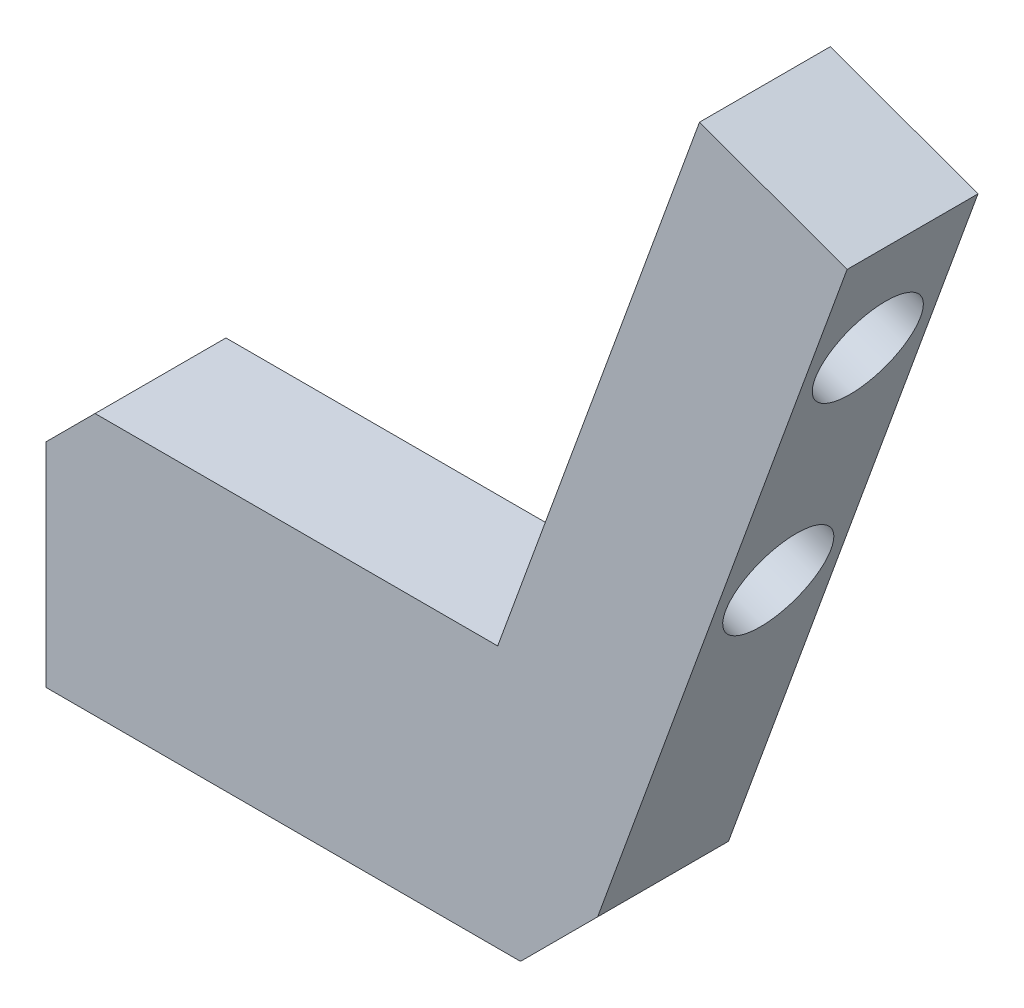
ISO-10303-21;
HEADER;
FILE_DESCRIPTION(('STEP AP214'),'2;1');
FILE_NAME('part.step','',(''),(''),'','','');
FILE_SCHEMA(('AUTOMOTIVE_DESIGN { 1 0 10303 214 1 1 1 1 }'));
ENDSEC;
DATA;
#1=APPLICATION_CONTEXT('core data for automotive mechanical design processes');
#2=APPLICATION_PROTOCOL_DEFINITION('international standard','automotive_design',2000,#1);
#3=PRODUCT_CONTEXT('',#1,'mechanical');
#4=PRODUCT('Part','Part','',(#3));
#5=PRODUCT_RELATED_PRODUCT_CATEGORY('part','',(#4));
#6=PRODUCT_DEFINITION_FORMATION('','',#4);
#7=PRODUCT_DEFINITION_CONTEXT('part definition',#1,'design');
#8=PRODUCT_DEFINITION('design','',#6,#7);
#9=PRODUCT_DEFINITION_SHAPE('','',#8);
#10=(LENGTH_UNIT() NAMED_UNIT(*) SI_UNIT(.MILLI.,.METRE.));
#11=(NAMED_UNIT(*) PLANE_ANGLE_UNIT() SI_UNIT($,.RADIAN.));
#12=(NAMED_UNIT(*) SI_UNIT($,.STERADIAN.) SOLID_ANGLE_UNIT());
#13=UNCERTAINTY_MEASURE_WITH_UNIT(LENGTH_MEASURE(1.E-05),#10,'distance_accuracy_value','');
#14=(GEOMETRIC_REPRESENTATION_CONTEXT(3) GLOBAL_UNCERTAINTY_ASSIGNED_CONTEXT((#13)) GLOBAL_UNIT_ASSIGNED_CONTEXT((#10,
#11,#12)) REPRESENTATION_CONTEXT('',''));
#15=CARTESIAN_POINT('',(0.,0.,0.));
#16=DIRECTION('',(0.,0.,1.));
#17=DIRECTION('',(1.,0.,0.));
#18=AXIS2_PLACEMENT_3D('',#15,#16,#17);
#19=CARTESIAN_POINT('',(-25.4,12.7,3.175));
#20=DIRECTION('',(1.,0.,0.));
#21=DIRECTION('',(0.,0.,-1.));
#22=AXIS2_PLACEMENT_3D('',#19,#20,#21);
#23=PLANE('',#22);
#24=DIRECTION('',(0.,-1.,0.));
#25=VECTOR('',#24,1.);
#26=CARTESIAN_POINT('',(-25.4,12.7,3.175));
#27=LINE('',#26,#25);
#28=CARTESIAN_POINT('',(-25.4,10.32,3.175));
#29=VERTEX_POINT('',#28);
#30=CARTESIAN_POINT('',(-25.4,0.,3.175));
#31=VERTEX_POINT('',#30);
#32=EDGE_CURVE('E132',#29,#31,#27,.T.);
#33=ORIENTED_EDGE('',*,*,#32,.F.);
#34=DIRECTION('',(0.,0.,-1.));
#35=VECTOR('',#34,1.);
#36=CARTESIAN_POINT('',(-25.4,10.32,3.175));
#37=LINE('',#36,#35);
#38=CARTESIAN_POINT('',(-25.4,10.32,-3.175));
#39=VERTEX_POINT('',#38);
#40=EDGE_CURVE('E169',#29,#39,#37,.T.);
#41=ORIENTED_EDGE('',*,*,#40,.T.);
#42=DIRECTION('',(0.,-1.,0.));
#43=VECTOR('',#42,1.);
#44=CARTESIAN_POINT('',(-25.4,12.7,-3.175));
#45=LINE('',#44,#43);
#46=CARTESIAN_POINT('',(-25.4,0.,-3.175));
#47=VERTEX_POINT('',#46);
#48=EDGE_CURVE('E131',#39,#47,#45,.T.);
#49=ORIENTED_EDGE('',*,*,#48,.T.);
#50=DIRECTION('',(0.,0.,-1.));
#51=VECTOR('',#50,1.);
#52=CARTESIAN_POINT('',(-25.4,0.,3.175));
#53=LINE('',#52,#51);
#54=EDGE_CURVE('E166',#31,#47,#53,.T.);
#55=ORIENTED_EDGE('',*,*,#54,.F.);
#56=EDGE_LOOP('',(#33,#41,#49,#55));
#57=FACE_BOUND('',#56,.T.);
#58=ADVANCED_FACE('F37',(#57),#23,.F.);
#59=CARTESIAN_POINT('',(-25.4,0.,3.175));
#60=DIRECTION('',(0.,1.,0.));
#61=DIRECTION('',(0.,0.,1.));
#62=AXIS2_PLACEMENT_3D('',#59,#60,#61);
#63=PLANE('',#62);
#64=CARTESIAN_POINT('',(-22.225,0.,0.));
#65=DIRECTION('',(0.,-1.,0.));
#66=DIRECTION('',(0.,0.,-1.));
#67=AXIS2_PLACEMENT_3D('',#64,#65,#66);
#68=CIRCLE('',#67,1.89865);
#69=CARTESIAN_POINT('',(-22.225,0.,-1.89865));
#70=VERTEX_POINT('',#69);
#71=EDGE_CURVE('E119',#70,#70,#68,.T.);
#72=ORIENTED_EDGE('',*,*,#71,.F.);
#73=EDGE_LOOP('',(#72));
#74=FACE_BOUND('',#73,.T.);
#75=CARTESIAN_POINT('',(-9.525,0.,0.));
#76=DIRECTION('',(0.,-1.,0.));
#77=DIRECTION('',(0.,0.,-1.));
#78=AXIS2_PLACEMENT_3D('',#75,#76,#77);
#79=CIRCLE('',#78,1.89865);
#80=CARTESIAN_POINT('',(-9.525,0.,-1.89865));
#81=VERTEX_POINT('',#80);
#82=EDGE_CURVE('E118',#81,#81,#79,.T.);
#83=ORIENTED_EDGE('',*,*,#82,.F.);
#84=EDGE_LOOP('',(#83));
#85=FACE_BOUND('',#84,.T.);
#86=DIRECTION('',(1.,0.,0.));
#87=VECTOR('',#86,1.);
#88=CARTESIAN_POINT('',(-25.4,0.,-3.175));
#89=LINE('',#88,#87);
#90=CARTESIAN_POINT('',(-2.38000000000002,0.,-3.175));
#91=VERTEX_POINT('',#90);
#92=EDGE_CURVE('E148',#47,#91,#89,.T.);
#93=ORIENTED_EDGE('',*,*,#92,.T.);
#94=DIRECTION('',(0.,0.,1.));
#95=VECTOR('',#94,1.);
#96=CARTESIAN_POINT('',(-2.38000000000002,0.,3.175));
#97=LINE('',#96,#95);
#98=CARTESIAN_POINT('',(-2.38000000000002,0.,3.175));
#99=VERTEX_POINT('',#98);
#100=EDGE_CURVE('E11',#91,#99,#97,.T.);
#101=ORIENTED_EDGE('',*,*,#100,.T.);
#102=DIRECTION('',(1.,0.,0.));
#103=VECTOR('',#102,1.);
#104=CARTESIAN_POINT('',(-25.4,0.,3.175));
#105=LINE('',#104,#103);
#106=EDGE_CURVE('E134',#31,#99,#105,.T.);
#107=ORIENTED_EDGE('',*,*,#106,.F.);
#108=ORIENTED_EDGE('',*,*,#54,.T.);
#109=EDGE_LOOP('',(#93,#101,#107,#108));
#110=FACE_BOUND('',#109,.T.);
#111=ADVANCED_FACE('F214',(#74,#85,#110),#63,.F.);
#112=CARTESIAN_POINT('',(0.,0.,3.175));
#113=DIRECTION('',(-0.93969262078591,0.342020143325666,0.));
#114=DIRECTION('',(-0.342020143325666,-0.93969262078591,0.));
#115=AXIS2_PLACEMENT_3D('',#112,#113,#114);
#116=PLANE('',#115);
#117=CARTESIAN_POINT('',(11.2935051326135,31.0286503383508,0.));
#118=DIRECTION('',(0.93969262078591,-0.342020143325666,0.));
#119=DIRECTION('',(0.342020143325666,0.93969262078591,0.));
#120=AXIS2_PLACEMENT_3D('',#117,#118,#119);
#121=CIRCLE('',#120,2.5527);
#122=CARTESIAN_POINT('',(12.1665799524809,33.4274036914309,0.));
#123=VERTEX_POINT('',#122);
#124=EDGE_CURVE('E268',#123,#123,#121,.T.);
#125=ORIENTED_EDGE('',*,*,#124,.F.);
#126=EDGE_LOOP('',(#125));
#127=FACE_BOUND('',#126,.T.);
#128=CARTESIAN_POINT('',(6.94984931237753,19.0945540543697,0.));
#129=DIRECTION('',(0.93969262078591,-0.342020143325666,0.));
#130=DIRECTION('',(0.342020143325666,0.93969262078591,0.));
#131=AXIS2_PLACEMENT_3D('',#128,#129,#130);
#132=CIRCLE('',#131,2.5527);
#133=CARTESIAN_POINT('',(7.82292413224496,21.4933074074499,0.));
#134=VERTEX_POINT('',#133);
#135=EDGE_CURVE('E271',#134,#134,#132,.T.);
#136=ORIENTED_EDGE('',*,*,#135,.F.);
#137=EDGE_LOOP('',(#136));
#138=FACE_BOUND('',#137,.T.);
#139=DIRECTION('',(0.342020143325666,0.93969262078591,0.));
#140=VECTOR('',#139,1.);
#141=CARTESIAN_POINT('',(0.,0.,3.175));
#142=LINE('',#141,#140);
#143=CARTESIAN_POINT('',(1.36196323540636,3.74196323540636,3.175));
#144=VERTEX_POINT('',#143);
#145=CARTESIAN_POINT('',(13.4653330427315,36.9956984803413,3.175));
#146=VERTEX_POINT('',#145);
#147=EDGE_CURVE('E137',#144,#146,#142,.T.);
#148=ORIENTED_EDGE('',*,*,#147,.F.);
#149=DIRECTION('',(0.,0.,-1.));
#150=VECTOR('',#149,1.);
#151=CARTESIAN_POINT('',(1.36196323540636,3.74196323540636,3.175));
#152=LINE('',#151,#150);
#153=CARTESIAN_POINT('',(1.36196323540636,3.74196323540636,-3.175));
#154=VERTEX_POINT('',#153);
#155=EDGE_CURVE('E47',#144,#154,#152,.T.);
#156=ORIENTED_EDGE('',*,*,#155,.T.);
#157=DIRECTION('',(0.342020143325666,0.93969262078591,0.));
#158=VECTOR('',#157,1.);
#159=CARTESIAN_POINT('',(0.,0.,-3.175));
#160=LINE('',#159,#158);
#161=CARTESIAN_POINT('',(13.4653330427315,36.9956984803413,-3.175));
#162=VERTEX_POINT('',#161);
#163=EDGE_CURVE('E150',#154,#162,#160,.T.);
#164=ORIENTED_EDGE('',*,*,#163,.T.);
#165=DIRECTION('',(0.,0.,-1.));
#166=VECTOR('',#165,1.);
#167=CARTESIAN_POINT('',(13.4653330427315,36.9956984803413,3.175));
#168=LINE('',#167,#166);
#169=EDGE_CURVE('E163',#146,#162,#168,.T.);
#170=ORIENTED_EDGE('',*,*,#169,.F.);
#171=EDGE_LOOP('',(#148,#156,#164,#170));
#172=FACE_BOUND('',#171,.T.);
#173=ADVANCED_FACE('F185',(#127,#138,#172),#116,.F.);
#174=CARTESIAN_POINT('',(13.4653330427315,36.9956984803413,3.175));
#175=DIRECTION('',(-0.342020143325664,-0.93969262078591,0.));
#176=DIRECTION('',(0.93969262078591,-0.342020143325665,0.));
#177=AXIS2_PLACEMENT_3D('',#174,#175,#176);
#178=PLANE('',#177);
#179=DIRECTION('',(-0.93969262078591,0.342020143325664,0.));
#180=VECTOR('',#179,1.);
#181=CARTESIAN_POINT('',(13.4653330427315,36.9956984803413,-3.175));
#182=LINE('',#181,#180);
#183=CARTESIAN_POINT('',(6.30487527234282,39.6018919724828,-3.175));
#184=VERTEX_POINT('',#183);
#185=EDGE_CURVE('E152',#162,#184,#182,.T.);
#186=ORIENTED_EDGE('',*,*,#185,.T.);
#187=DIRECTION('',(0.,0.,-1.));
#188=VECTOR('',#187,1.);
#189=CARTESIAN_POINT('',(6.30487527234282,39.6018919724828,3.175));
#190=LINE('',#189,#188);
#191=CARTESIAN_POINT('',(6.30487527234282,39.6018919724828,3.175));
#192=VERTEX_POINT('',#191);
#193=EDGE_CURVE('E160',#192,#184,#190,.T.);
#194=ORIENTED_EDGE('',*,*,#193,.F.);
#195=DIRECTION('',(-0.93969262078591,0.342020143325664,0.));
#196=VECTOR('',#195,1.);
#197=CARTESIAN_POINT('',(13.4653330427315,36.9956984803413,3.175));
#198=LINE('',#197,#196);
#199=EDGE_CURVE('E139',#146,#192,#198,.T.);
#200=ORIENTED_EDGE('',*,*,#199,.F.);
#201=ORIENTED_EDGE('',*,*,#169,.T.);
#202=EDGE_LOOP('',(#186,#194,#200,#201));
#203=FACE_BOUND('',#202,.T.);
#204=ADVANCED_FACE('F197',(#203),#178,.F.);
#205=CARTESIAN_POINT('',(6.30487527234282,39.6018919724828,3.175));
#206=DIRECTION('',(0.93969262078591,-0.342020143325665,0.));
#207=DIRECTION('',(0.342020143325665,0.93969262078591,0.));
#208=AXIS2_PLACEMENT_3D('',#205,#206,#207);
#209=PLANE('',#208);
#210=CARTESIAN_POINT('',(4.13304736222486,33.6348438304923,0.));
#211=DIRECTION('',(0.93969262078591,-0.342020143325665,0.));
#212=DIRECTION('',(0.342020143325665,0.93969262078591,0.));
#213=AXIS2_PLACEMENT_3D('',#210,#211,#212);
#214=CIRCLE('',#213,2.5527);
#215=CARTESIAN_POINT('',(5.00612218209229,36.0335971835725,0.));
#216=VERTEX_POINT('',#215);
#217=EDGE_CURVE('E42',#216,#216,#214,.T.);
#218=ORIENTED_EDGE('',*,*,#217,.T.);
#219=EDGE_LOOP('',(#218));
#220=FACE_BOUND('',#219,.T.);
#221=CARTESIAN_POINT('',(-0.210608458011091,21.7007475465113,0.));
#222=DIRECTION('',(0.93969262078591,-0.342020143325665,0.));
#223=DIRECTION('',(0.342020143325665,0.93969262078591,0.));
#224=AXIS2_PLACEMENT_3D('',#221,#222,#223);
#225=CIRCLE('',#224,2.5527);
#226=CARTESIAN_POINT('',(0.662466361856334,24.0995008995915,0.));
#227=VERTEX_POINT('',#226);
#228=EDGE_CURVE('E125',#227,#227,#225,.T.);
#229=ORIENTED_EDGE('',*,*,#228,.T.);
#230=EDGE_LOOP('',(#229));
#231=FACE_BOUND('',#230,.T.);
#232=DIRECTION('',(-0.342020143325665,-0.93969262078591,0.));
#233=VECTOR('',#232,1.);
#234=CARTESIAN_POINT('',(6.30487527234282,39.6018919724828,-3.175));
#235=LINE('',#234,#233);
#236=CARTESIAN_POINT('',(-3.48661265108571,12.7,-3.175));
#237=VERTEX_POINT('',#236);
#238=EDGE_CURVE('E154',#184,#237,#235,.T.);
#239=ORIENTED_EDGE('',*,*,#238,.T.);
#240=DIRECTION('',(0.,0.,-1.));
#241=VECTOR('',#240,1.);
#242=CARTESIAN_POINT('',(-3.48661265108571,12.7,3.175));
#243=LINE('',#242,#241);
#244=CARTESIAN_POINT('',(-3.48661265108571,12.7,3.175));
#245=VERTEX_POINT('',#244);
#246=EDGE_CURVE('E146',#245,#237,#243,.T.);
#247=ORIENTED_EDGE('',*,*,#246,.F.);
#248=DIRECTION('',(-0.342020143325665,-0.93969262078591,0.));
#249=VECTOR('',#248,1.);
#250=CARTESIAN_POINT('',(6.30487527234282,39.6018919724828,3.175));
#251=LINE('',#250,#249);
#252=EDGE_CURVE('E141',#192,#245,#251,.T.);
#253=ORIENTED_EDGE('',*,*,#252,.F.);
#254=ORIENTED_EDGE('',*,*,#193,.T.);
#255=EDGE_LOOP('',(#239,#247,#253,#254));
#256=FACE_BOUND('',#255,.T.);
#257=ADVANCED_FACE('F201',(#220,#231,#256),#209,.F.);
#258=CARTESIAN_POINT('',(-25.4,12.7,3.175));
#259=DIRECTION('',(0.,-1.,0.));
#260=DIRECTION('',(0.,0.,-1.));
#261=AXIS2_PLACEMENT_3D('',#258,#259,#260);
#262=PLANE('',#261);
#263=DIRECTION('',(-1.,0.,0.));
#264=VECTOR('',#263,1.);
#265=CARTESIAN_POINT('',(-25.4,12.7,-3.175));
#266=LINE('',#265,#264);
#267=CARTESIAN_POINT('',(-23.02,12.7,-3.175));
#268=VERTEX_POINT('',#267);
#269=EDGE_CURVE('E135',#237,#268,#266,.T.);
#270=ORIENTED_EDGE('',*,*,#269,.T.);
#271=DIRECTION('',(0.,0.,1.));
#272=VECTOR('',#271,1.);
#273=CARTESIAN_POINT('',(-23.02,12.7,3.175));
#274=LINE('',#273,#272);
#275=CARTESIAN_POINT('',(-23.02,12.7,3.175));
#276=VERTEX_POINT('',#275);
#277=EDGE_CURVE('E176',#268,#276,#274,.T.);
#278=ORIENTED_EDGE('',*,*,#277,.T.);
#279=DIRECTION('',(-1.,0.,0.));
#280=VECTOR('',#279,1.);
#281=CARTESIAN_POINT('',(-25.4,12.7,3.175));
#282=LINE('',#281,#280);
#283=EDGE_CURVE('E143',#245,#276,#282,.T.);
#284=ORIENTED_EDGE('',*,*,#283,.F.);
#285=ORIENTED_EDGE('',*,*,#246,.T.);
#286=EDGE_LOOP('',(#270,#278,#284,#285));
#287=FACE_BOUND('',#286,.T.);
#288=ADVANCED_FACE('F244',(#287),#262,.F.);
#289=CARTESIAN_POINT('',(0.,0.,3.175));
#290=DIRECTION('',(0.,0.,1.));
#291=DIRECTION('',(1.,0.,0.));
#292=AXIS2_PLACEMENT_3D('',#289,#290,#291);
#293=PLANE('',#292);
#294=ORIENTED_EDGE('',*,*,#283,.T.);
#295=DIRECTION('',(0.707106781186549,0.707106781186546,0.));
#296=VECTOR('',#295,1.);
#297=CARTESIAN_POINT('',(-17.86,17.86,3.175));
#298=LINE('',#297,#296);
#299=EDGE_CURVE('E179',#276,#29,#298,.F.);
#300=ORIENTED_EDGE('',*,*,#299,.T.);
#301=ORIENTED_EDGE('',*,*,#32,.T.);
#302=ORIENTED_EDGE('',*,*,#106,.T.);
#303=DIRECTION('',(-0.707106781186549,-0.707106781186546,0.));
#304=VECTOR('',#303,1.);
#305=CARTESIAN_POINT('',(-1.19,1.19000000000001,3.175));
#306=LINE('',#305,#304);
#307=EDGE_CURVE('E54',#99,#144,#306,.F.);
#308=ORIENTED_EDGE('',*,*,#307,.T.);
#309=ORIENTED_EDGE('',*,*,#147,.T.);
#310=ORIENTED_EDGE('',*,*,#199,.T.);
#311=ORIENTED_EDGE('',*,*,#252,.T.);
#312=EDGE_LOOP('',(#294,#300,#301,#302,#308,#309,#310,#311));
#313=FACE_BOUND('',#312,.T.);
#314=ADVANCED_FACE('F204',(#313),#293,.T.);
#315=CARTESIAN_POINT('',(0.,0.,-3.175));
#316=DIRECTION('',(0.,0.,1.));
#317=DIRECTION('',(1.,0.,0.));
#318=AXIS2_PLACEMENT_3D('',#315,#316,#317);
#319=PLANE('',#318);
#320=ORIENTED_EDGE('',*,*,#48,.F.);
#321=DIRECTION('',(-0.707106781186549,-0.707106781186546,0.));
#322=VECTOR('',#321,1.);
#323=CARTESIAN_POINT('',(-25.4,10.32,-3.175));
#324=LINE('',#323,#322);
#325=EDGE_CURVE('E174',#39,#268,#324,.F.);
#326=ORIENTED_EDGE('',*,*,#325,.T.);
#327=ORIENTED_EDGE('',*,*,#269,.F.);
#328=ORIENTED_EDGE('',*,*,#238,.F.);
#329=ORIENTED_EDGE('',*,*,#185,.F.);
#330=ORIENTED_EDGE('',*,*,#163,.F.);
#331=DIRECTION('',(0.707106781186549,0.707106781186546,0.));
#332=VECTOR('',#331,1.);
#333=CARTESIAN_POINT('',(1.36196323540636,3.74196323540636,-3.175));
#334=LINE('',#333,#332);
#335=EDGE_CURVE('E172',#154,#91,#334,.F.);
#336=ORIENTED_EDGE('',*,*,#335,.T.);
#337=ORIENTED_EDGE('',*,*,#92,.F.);
#338=EDGE_LOOP('',(#320,#326,#327,#328,#329,#330,#336,#337));
#339=FACE_BOUND('',#338,.T.);
#340=ADVANCED_FACE('F191',(#339),#319,.F.);
#341=CARTESIAN_POINT('',(-9.525,10.16,0.));
#342=DIRECTION('',(0.,-1.,0.));
#343=DIRECTION('',(0.,0.,-1.));
#344=AXIS2_PLACEMENT_3D('',#341,#342,#343);
#345=CONICAL_SURFACE('',#344,1.89865,1.02974425867665);
#346=CARTESIAN_POINT('',(-9.525,11.3008240143167,0.));
#347=VERTEX_POINT('',#346);
#348=VERTEX_LOOP('',#347);
#349=FACE_BOUND('',#348,.T.);
#350=CARTESIAN_POINT('',(-9.525,10.16,0.));
#351=DIRECTION('',(0.,-1.,0.));
#352=DIRECTION('',(0.,0.,-1.));
#353=AXIS2_PLACEMENT_3D('',#350,#351,#352);
#354=CIRCLE('',#353,1.89865);
#355=CARTESIAN_POINT('',(-9.525,10.16,-1.89865));
#356=VERTEX_POINT('',#355);
#357=EDGE_CURVE('E122',#356,#356,#354,.T.);
#358=ORIENTED_EDGE('',*,*,#357,.T.);
#359=EDGE_LOOP('',(#358));
#360=FACE_BOUND('',#359,.T.);
#361=ADVANCED_FACE('F250',(#349,#360),#345,.F.);
#362=CARTESIAN_POINT('',(-9.525,0.,0.));
#363=DIRECTION('',(0.,-1.,0.));
#364=DIRECTION('',(0.,0.,-1.));
#365=AXIS2_PLACEMENT_3D('',#362,#363,#364);
#366=CYLINDRICAL_SURFACE('',#365,1.89865);
#367=ORIENTED_EDGE('',*,*,#357,.F.);
#368=EDGE_LOOP('',(#367));
#369=FACE_BOUND('',#368,.T.);
#370=ORIENTED_EDGE('',*,*,#82,.T.);
#371=EDGE_LOOP('',(#370));
#372=FACE_BOUND('',#371,.T.);
#373=ADVANCED_FACE('F112',(#369,#372),#366,.F.);
#374=CARTESIAN_POINT('',(-22.225,10.16,0.));
#375=DIRECTION('',(0.,-1.,0.));
#376=DIRECTION('',(0.,0.,-1.));
#377=AXIS2_PLACEMENT_3D('',#374,#375,#376);
#378=CONICAL_SURFACE('',#377,1.89865,1.02974425867665);
#379=CARTESIAN_POINT('',(-22.225,11.3008240143167,0.));
#380=VERTEX_POINT('',#379);
#381=VERTEX_LOOP('',#380);
#382=FACE_BOUND('',#381,.T.);
#383=CARTESIAN_POINT('',(-22.225,10.16,0.));
#384=DIRECTION('',(0.,-1.,0.));
#385=DIRECTION('',(0.,0.,-1.));
#386=AXIS2_PLACEMENT_3D('',#383,#384,#385);
#387=CIRCLE('',#386,1.89865);
#388=CARTESIAN_POINT('',(-22.225,10.16,-1.89865));
#389=VERTEX_POINT('',#388);
#390=EDGE_CURVE('E116',#389,#389,#387,.T.);
#391=ORIENTED_EDGE('',*,*,#390,.T.);
#392=EDGE_LOOP('',(#391));
#393=FACE_BOUND('',#392,.T.);
#394=ADVANCED_FACE('F108',(#382,#393),#378,.F.);
#395=CARTESIAN_POINT('',(-22.225,0.,0.));
#396=DIRECTION('',(0.,-1.,0.));
#397=DIRECTION('',(0.,0.,-1.));
#398=AXIS2_PLACEMENT_3D('',#395,#396,#397);
#399=CYLINDRICAL_SURFACE('',#398,1.89865);
#400=ORIENTED_EDGE('',*,*,#390,.F.);
#401=EDGE_LOOP('',(#400));
#402=FACE_BOUND('',#401,.T.);
#403=ORIENTED_EDGE('',*,*,#71,.T.);
#404=EDGE_LOOP('',(#403));
#405=FACE_BOUND('',#404,.T.);
#406=ADVANCED_FACE('F111',(#402,#405),#399,.F.);
#407=CARTESIAN_POINT('',(-25.4,10.32,3.175));
#408=DIRECTION('',(0.707106781186546,-0.707106781186549,0.));
#409=DIRECTION('',(0.,0.,-1.));
#410=AXIS2_PLACEMENT_3D('',#407,#408,#409);
#411=PLANE('',#410);
#412=ORIENTED_EDGE('',*,*,#299,.F.);
#413=ORIENTED_EDGE('',*,*,#277,.F.);
#414=ORIENTED_EDGE('',*,*,#325,.F.);
#415=ORIENTED_EDGE('',*,*,#40,.F.);
#416=EDGE_LOOP('',(#412,#413,#414,#415));
#417=FACE_BOUND('',#416,.T.);
#418=ADVANCED_FACE('F211',(#417),#411,.F.);
#419=CARTESIAN_POINT('',(1.36196323540636,3.74196323540636,3.175));
#420=DIRECTION('',(-0.707106781186546,0.707106781186549,0.));
#421=DIRECTION('',(0.,0.,-1.));
#422=AXIS2_PLACEMENT_3D('',#419,#420,#421);
#423=PLANE('',#422);
#424=ORIENTED_EDGE('',*,*,#307,.F.);
#425=ORIENTED_EDGE('',*,*,#100,.F.);
#426=ORIENTED_EDGE('',*,*,#335,.F.);
#427=ORIENTED_EDGE('',*,*,#155,.F.);
#428=EDGE_LOOP('',(#424,#425,#426,#427));
#429=FACE_BOUND('',#428,.T.);
#430=ADVANCED_FACE('F40',(#429),#423,.F.);
#431=CARTESIAN_POINT('',(6.94984931237753,19.0945540543697,0.));
#432=DIRECTION('',(0.93969262078591,-0.342020143325666,0.));
#433=DIRECTION('',(0.342020143325666,0.93969262078591,0.));
#434=AXIS2_PLACEMENT_3D('',#431,#432,#433);
#435=CYLINDRICAL_SURFACE('',#434,2.5527);
#436=ORIENTED_EDGE('',*,*,#135,.T.);
#437=EDGE_LOOP('',(#436));
#438=FACE_BOUND('',#437,.T.);
#439=ORIENTED_EDGE('',*,*,#228,.F.);
#440=EDGE_LOOP('',(#439));
#441=FACE_BOUND('',#440,.T.);
#442=ADVANCED_FACE('F216',(#438,#441),#435,.F.);
#443=CARTESIAN_POINT('',(11.2935051326135,31.0286503383508,0.));
#444=DIRECTION('',(0.93969262078591,-0.342020143325666,0.));
#445=DIRECTION('',(0.342020143325666,0.93969262078591,0.));
#446=AXIS2_PLACEMENT_3D('',#443,#444,#445);
#447=CYLINDRICAL_SURFACE('',#446,2.5527);
#448=ORIENTED_EDGE('',*,*,#124,.T.);
#449=EDGE_LOOP('',(#448));
#450=FACE_BOUND('',#449,.T.);
#451=ORIENTED_EDGE('',*,*,#217,.F.);
#452=EDGE_LOOP('',(#451));
#453=FACE_BOUND('',#452,.T.);
#454=ADVANCED_FACE('F221',(#450,#453),#447,.F.);
#455=CLOSED_SHELL('',(#58,#111,#173,#204,#257,#288,#314,#340,#361,#373,#394,#406,#418,#430,#442,#454));
#456=MANIFOLD_SOLID_BREP('B2',#455);
#457=ADVANCED_BREP_SHAPE_REPRESENTATION('',(#18,#456),#14);
#458=SHAPE_DEFINITION_REPRESENTATION(#9,#457);
ENDSEC;
END-ISO-10303-21;
